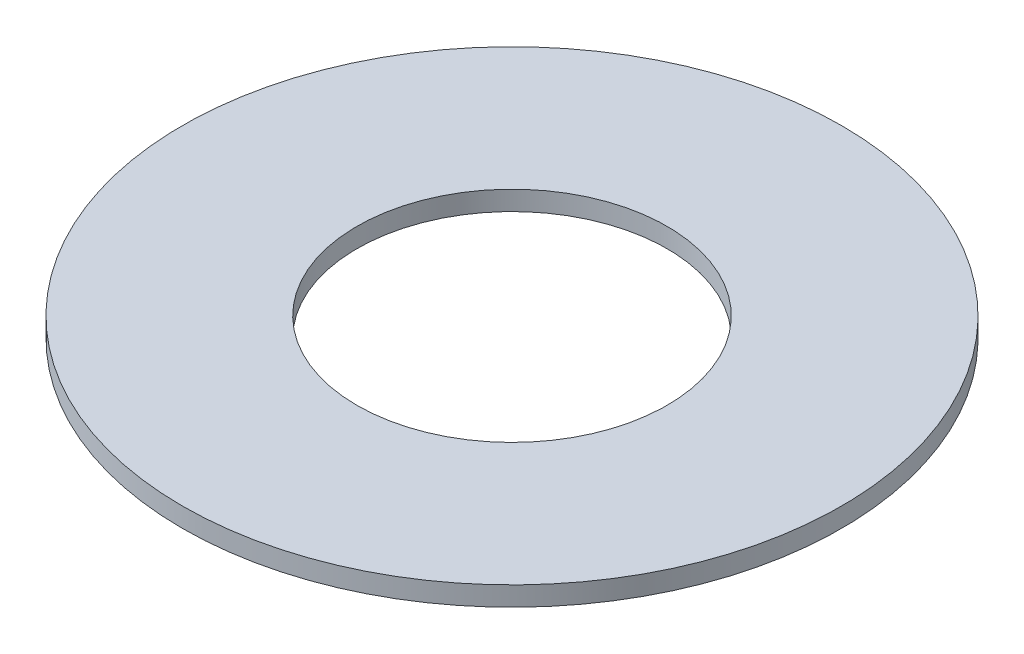
ISO-10303-21;
HEADER;
FILE_DESCRIPTION(('STEP AP214'),'2;1');
FILE_NAME('part.step','',(''),(''),'','','');
FILE_SCHEMA(('AUTOMOTIVE_DESIGN { 1 0 10303 214 1 1 1 1 }'));
ENDSEC;
DATA;
#1=APPLICATION_CONTEXT('core data for automotive mechanical design processes');
#2=APPLICATION_PROTOCOL_DEFINITION('international standard','automotive_design',2000,#1);
#3=PRODUCT_CONTEXT('',#1,'mechanical');
#4=PRODUCT('Part','Part','',(#3));
#5=PRODUCT_RELATED_PRODUCT_CATEGORY('part','',(#4));
#6=PRODUCT_DEFINITION_FORMATION('','',#4);
#7=PRODUCT_DEFINITION_CONTEXT('part definition',#1,'design');
#8=PRODUCT_DEFINITION('design','',#6,#7);
#9=PRODUCT_DEFINITION_SHAPE('','',#8);
#10=(LENGTH_UNIT() NAMED_UNIT(*) SI_UNIT(.MILLI.,.METRE.));
#11=(NAMED_UNIT(*) PLANE_ANGLE_UNIT() SI_UNIT($,.RADIAN.));
#12=(NAMED_UNIT(*) SI_UNIT($,.STERADIAN.) SOLID_ANGLE_UNIT());
#13=UNCERTAINTY_MEASURE_WITH_UNIT(LENGTH_MEASURE(1.E-05),#10,'distance_accuracy_value','');
#14=(GEOMETRIC_REPRESENTATION_CONTEXT(3) GLOBAL_UNCERTAINTY_ASSIGNED_CONTEXT((#13)) GLOBAL_UNIT_ASSIGNED_CONTEXT((#10,
#11,#12)) REPRESENTATION_CONTEXT('',''));
#15=CARTESIAN_POINT('',(0.,0.,0.));
#16=DIRECTION('',(0.,0.,1.));
#17=DIRECTION('',(1.,0.,0.));
#18=AXIS2_PLACEMENT_3D('',#15,#16,#17);
#19=CARTESIAN_POINT('',(0.,5.,0.));
#20=DIRECTION('',(0.,-1.,0.));
#21=DIRECTION('',(0.,0.,-1.));
#22=AXIS2_PLACEMENT_3D('',#19,#20,#21);
#23=CYLINDRICAL_SURFACE('',#22,85.);
#24=CARTESIAN_POINT('',(0.,5.,0.));
#25=DIRECTION('',(0.,1.,0.));
#26=DIRECTION('',(0.,0.,1.));
#27=AXIS2_PLACEMENT_3D('',#24,#25,#26);
#28=CIRCLE('',#27,85.);
#29=CARTESIAN_POINT('',(0.,5.,85.));
#30=VERTEX_POINT('',#29);
#31=EDGE_CURVE('E10',#30,#30,#28,.T.);
#32=ORIENTED_EDGE('',*,*,#31,.F.);
#33=EDGE_LOOP('',(#32));
#34=FACE_BOUND('',#33,.T.);
#35=CARTESIAN_POINT('',(0.,0.,0.));
#36=DIRECTION('',(0.,1.,0.));
#37=DIRECTION('',(0.,0.,1.));
#38=AXIS2_PLACEMENT_3D('',#35,#36,#37);
#39=CIRCLE('',#38,85.);
#40=CARTESIAN_POINT('',(0.,0.,85.));
#41=VERTEX_POINT('',#40);
#42=EDGE_CURVE('E37',#41,#41,#39,.T.);
#43=ORIENTED_EDGE('',*,*,#42,.T.);
#44=EDGE_LOOP('',(#43));
#45=FACE_BOUND('',#44,.T.);
#46=ADVANCED_FACE('F40',(#34,#45),#23,.T.);
#47=CARTESIAN_POINT('',(0.,5.,0.));
#48=DIRECTION('',(0.,1.,0.));
#49=DIRECTION('',(0.,0.,1.));
#50=AXIS2_PLACEMENT_3D('',#47,#48,#49);
#51=PLANE('',#50);
#52=CARTESIAN_POINT('',(0.,5.,0.));
#53=DIRECTION('',(0.,1.,0.));
#54=DIRECTION('',(0.,0.,1.));
#55=AXIS2_PLACEMENT_3D('',#52,#53,#54);
#56=CIRCLE('',#55,40.);
#57=CARTESIAN_POINT('',(0.,5.,40.));
#58=VERTEX_POINT('',#57);
#59=EDGE_CURVE('E50',#58,#58,#56,.T.);
#60=ORIENTED_EDGE('',*,*,#59,.F.);
#61=EDGE_LOOP('',(#60));
#62=FACE_BOUND('',#61,.T.);
#63=ORIENTED_EDGE('',*,*,#31,.T.);
#64=EDGE_LOOP('',(#63));
#65=FACE_BOUND('',#64,.T.);
#66=ADVANCED_FACE('F59',(#62,#65),#51,.T.);
#67=CARTESIAN_POINT('',(0.,0.,0.));
#68=DIRECTION('',(0.,1.,0.));
#69=DIRECTION('',(0.,0.,1.));
#70=AXIS2_PLACEMENT_3D('',#67,#68,#69);
#71=PLANE('',#70);
#72=CARTESIAN_POINT('',(0.,0.,0.));
#73=DIRECTION('',(0.,1.,0.));
#74=DIRECTION('',(0.,0.,1.));
#75=AXIS2_PLACEMENT_3D('',#72,#73,#74);
#76=CIRCLE('',#75,40.);
#77=CARTESIAN_POINT('',(0.,0.,40.));
#78=VERTEX_POINT('',#77);
#79=EDGE_CURVE('E47',#78,#78,#76,.T.);
#80=ORIENTED_EDGE('',*,*,#79,.T.);
#81=EDGE_LOOP('',(#80));
#82=FACE_BOUND('',#81,.T.);
#83=ORIENTED_EDGE('',*,*,#42,.F.);
#84=EDGE_LOOP('',(#83));
#85=FACE_BOUND('',#84,.T.);
#86=ADVANCED_FACE('F58',(#82,#85),#71,.F.);
#87=CARTESIAN_POINT('',(0.,5.,0.));
#88=DIRECTION('',(0.,-1.,0.));
#89=DIRECTION('',(0.,0.,-1.));
#90=AXIS2_PLACEMENT_3D('',#87,#88,#89);
#91=CYLINDRICAL_SURFACE('',#90,40.);
#92=ORIENTED_EDGE('',*,*,#59,.T.);
#93=EDGE_LOOP('',(#92));
#94=FACE_BOUND('',#93,.T.);
#95=ORIENTED_EDGE('',*,*,#79,.F.);
#96=EDGE_LOOP('',(#95));
#97=FACE_BOUND('',#96,.T.);
#98=ADVANCED_FACE('F54',(#94,#97),#91,.F.);
#99=CLOSED_SHELL('',(#46,#66,#86,#98));
#100=MANIFOLD_SOLID_BREP('B2',#99);
#101=ADVANCED_BREP_SHAPE_REPRESENTATION('',(#18,#100),#14);
#102=SHAPE_DEFINITION_REPRESENTATION(#9,#101);
ENDSEC;
END-ISO-10303-21;
